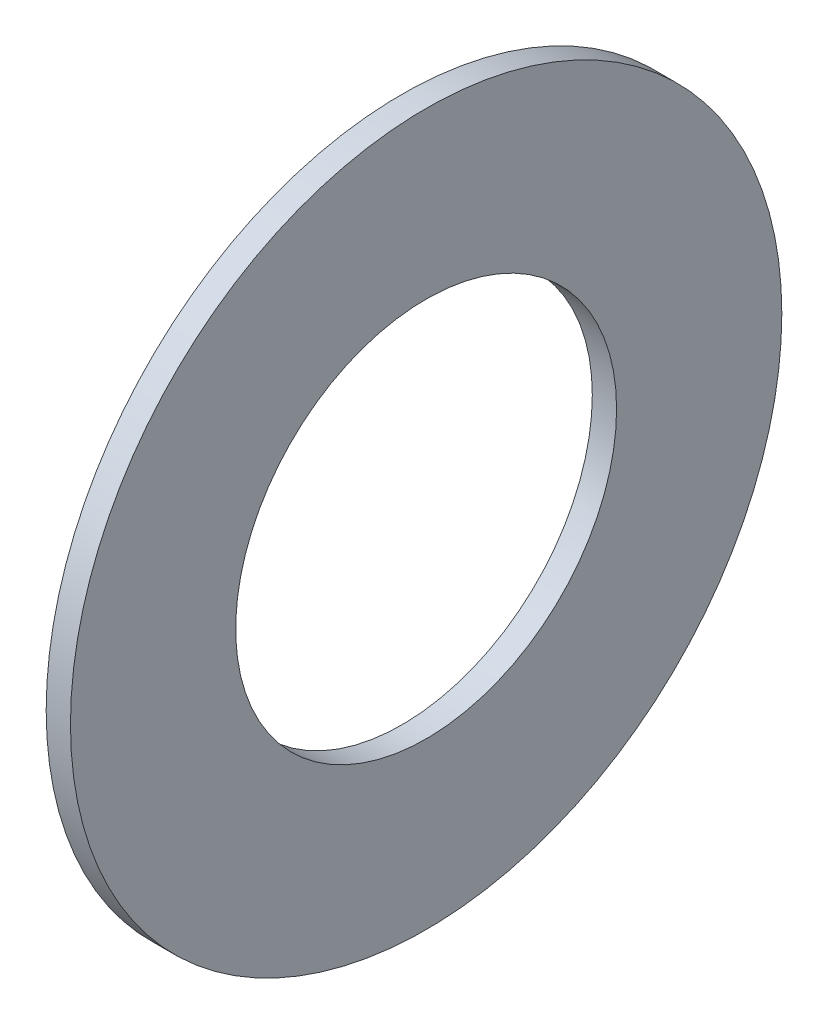
ISO-10303-21;
HEADER;
FILE_DESCRIPTION(('STEP AP214'),'2;1');
FILE_NAME('part.step','',(''),(''),'','','');
FILE_SCHEMA(('AUTOMOTIVE_DESIGN { 1 0 10303 214 1 1 1 1 }'));
ENDSEC;
DATA;
#1=APPLICATION_CONTEXT('core data for automotive mechanical design processes');
#2=APPLICATION_PROTOCOL_DEFINITION('international standard','automotive_design',2000,#1);
#3=PRODUCT_CONTEXT('',#1,'mechanical');
#4=PRODUCT('Part','Part','',(#3));
#5=PRODUCT_RELATED_PRODUCT_CATEGORY('part','',(#4));
#6=PRODUCT_DEFINITION_FORMATION('','',#4);
#7=PRODUCT_DEFINITION_CONTEXT('part definition',#1,'design');
#8=PRODUCT_DEFINITION('design','',#6,#7);
#9=PRODUCT_DEFINITION_SHAPE('','',#8);
#10=(LENGTH_UNIT() NAMED_UNIT(*) SI_UNIT(.MILLI.,.METRE.));
#11=(NAMED_UNIT(*) PLANE_ANGLE_UNIT() SI_UNIT($,.RADIAN.));
#12=(NAMED_UNIT(*) SI_UNIT($,.STERADIAN.) SOLID_ANGLE_UNIT());
#13=UNCERTAINTY_MEASURE_WITH_UNIT(LENGTH_MEASURE(1.E-05),#10,'distance_accuracy_value','');
#14=(GEOMETRIC_REPRESENTATION_CONTEXT(3) GLOBAL_UNCERTAINTY_ASSIGNED_CONTEXT((#13)) GLOBAL_UNIT_ASSIGNED_CONTEXT((#10,
#11,#12)) REPRESENTATION_CONTEXT('',''));
#15=CARTESIAN_POINT('',(0.,0.,0.));
#16=DIRECTION('',(0.,0.,1.));
#17=DIRECTION('',(1.,0.,0.));
#18=AXIS2_PLACEMENT_3D('',#15,#16,#17);
#19=CARTESIAN_POINT('',(0.8128,0.,0.));
#20=DIRECTION('',(1.,0.,0.));
#21=DIRECTION('',(0.,0.,-1.));
#22=AXIS2_PLACEMENT_3D('',#19,#20,#21);
#23=PLANE('',#22);
#24=CARTESIAN_POINT('',(0.8128,0.,0.));
#25=DIRECTION('',(1.,0.,0.));
#26=DIRECTION('',(0.,0.,-1.));
#27=AXIS2_PLACEMENT_3D('',#24,#25,#26);
#28=CIRCLE('',#27,11.90625);
#29=CARTESIAN_POINT('',(0.8128,0.,-11.90625));
#30=VERTEX_POINT('',#29);
#31=EDGE_CURVE('E10',#30,#30,#28,.T.);
#32=ORIENTED_EDGE('',*,*,#31,.T.);
#33=EDGE_LOOP('',(#32));
#34=FACE_BOUND('',#33,.T.);
#35=CARTESIAN_POINT('',(0.8128,0.,0.));
#36=DIRECTION('',(1.,0.,0.));
#37=DIRECTION('',(0.,0.,-1.));
#38=AXIS2_PLACEMENT_3D('',#35,#36,#37);
#39=CIRCLE('',#38,6.3754);
#40=CARTESIAN_POINT('',(0.8128,0.,-6.3754));
#41=VERTEX_POINT('',#40);
#42=EDGE_CURVE('E47',#41,#41,#39,.T.);
#43=ORIENTED_EDGE('',*,*,#42,.F.);
#44=EDGE_LOOP('',(#43));
#45=FACE_BOUND('',#44,.T.);
#46=ADVANCED_FACE('F36',(#34,#45),#23,.T.);
#47=CARTESIAN_POINT('',(0.,0.,0.));
#48=DIRECTION('',(1.,0.,0.));
#49=DIRECTION('',(0.,0.,-1.));
#50=AXIS2_PLACEMENT_3D('',#47,#48,#49);
#51=PLANE('',#50);
#52=CARTESIAN_POINT('',(0.,0.,0.));
#53=DIRECTION('',(1.,0.,0.));
#54=DIRECTION('',(0.,0.,-1.));
#55=AXIS2_PLACEMENT_3D('',#52,#53,#54);
#56=CIRCLE('',#55,11.90625);
#57=CARTESIAN_POINT('',(0.,0.,-11.90625));
#58=VERTEX_POINT('',#57);
#59=EDGE_CURVE('E40',#58,#58,#56,.T.);
#60=ORIENTED_EDGE('',*,*,#59,.F.);
#61=EDGE_LOOP('',(#60));
#62=FACE_BOUND('',#61,.T.);
#63=CARTESIAN_POINT('',(0.,0.,0.));
#64=DIRECTION('',(1.,0.,0.));
#65=DIRECTION('',(0.,0.,-1.));
#66=AXIS2_PLACEMENT_3D('',#63,#64,#65);
#67=CIRCLE('',#66,6.3754);
#68=CARTESIAN_POINT('',(0.,0.,-6.3754));
#69=VERTEX_POINT('',#68);
#70=EDGE_CURVE('E49',#69,#69,#67,.T.);
#71=ORIENTED_EDGE('',*,*,#70,.T.);
#72=EDGE_LOOP('',(#71));
#73=FACE_BOUND('',#72,.T.);
#74=ADVANCED_FACE('F59',(#62,#73),#51,.F.);
#75=CARTESIAN_POINT('',(0.8128,0.,0.));
#76=DIRECTION('',(-1.,0.,0.));
#77=DIRECTION('',(0.,0.,1.));
#78=AXIS2_PLACEMENT_3D('',#75,#76,#77);
#79=CYLINDRICAL_SURFACE('',#78,11.90625);
#80=ORIENTED_EDGE('',*,*,#31,.F.);
#81=EDGE_LOOP('',(#80));
#82=FACE_BOUND('',#81,.T.);
#83=ORIENTED_EDGE('',*,*,#59,.T.);
#84=EDGE_LOOP('',(#83));
#85=FACE_BOUND('',#84,.T.);
#86=ADVANCED_FACE('F38',(#82,#85),#79,.T.);
#87=CARTESIAN_POINT('',(0.8128,0.,0.));
#88=DIRECTION('',(-1.,0.,0.));
#89=DIRECTION('',(0.,0.,1.));
#90=AXIS2_PLACEMENT_3D('',#87,#88,#89);
#91=CYLINDRICAL_SURFACE('',#90,6.3754);
#92=ORIENTED_EDGE('',*,*,#42,.T.);
#93=EDGE_LOOP('',(#92));
#94=FACE_BOUND('',#93,.T.);
#95=ORIENTED_EDGE('',*,*,#70,.F.);
#96=EDGE_LOOP('',(#95));
#97=FACE_BOUND('',#96,.T.);
#98=ADVANCED_FACE('F55',(#94,#97),#91,.F.);
#99=CLOSED_SHELL('',(#46,#74,#86,#98));
#100=MANIFOLD_SOLID_BREP('B2',#99);
#101=ADVANCED_BREP_SHAPE_REPRESENTATION('',(#18,#100),#14);
#102=SHAPE_DEFINITION_REPRESENTATION(#9,#101);
ENDSEC;
END-ISO-10303-21;
